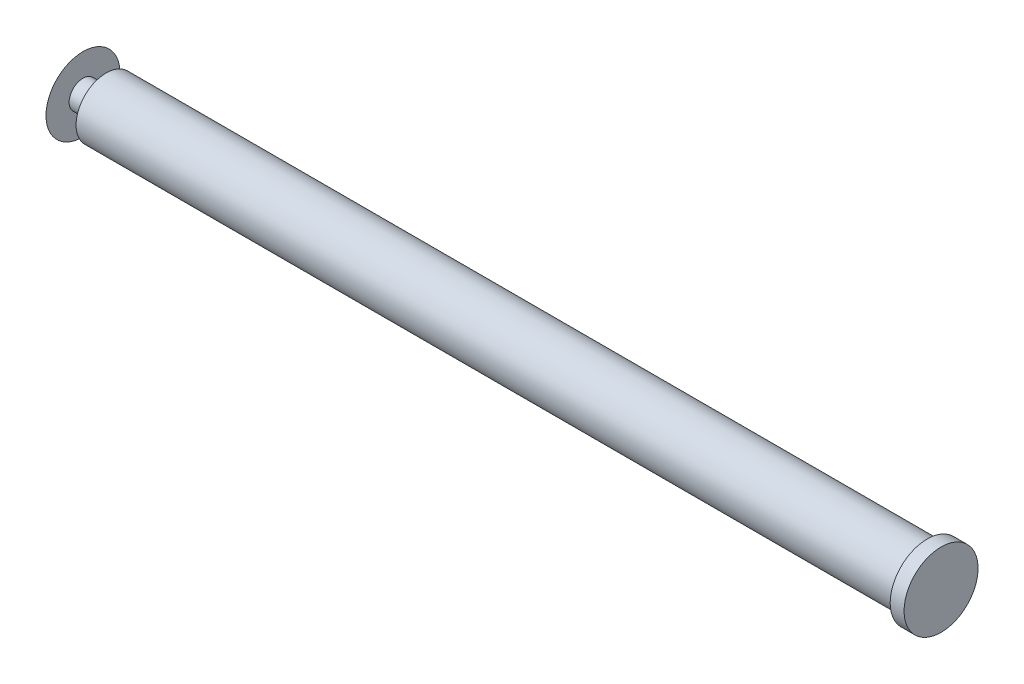
ISO-10303-21;
HEADER;
FILE_DESCRIPTION(('STEP AP214'),'2;1');
FILE_NAME('part.step','',(''),(''),'','','');
FILE_SCHEMA(('AUTOMOTIVE_DESIGN { 1 0 10303 214 1 1 1 1 }'));
ENDSEC;
DATA;
#1=APPLICATION_CONTEXT('core data for automotive mechanical design processes');
#2=APPLICATION_PROTOCOL_DEFINITION('international standard','automotive_design',2000,#1);
#3=PRODUCT_CONTEXT('',#1,'mechanical');
#4=PRODUCT('Part','Part','',(#3));
#5=PRODUCT_RELATED_PRODUCT_CATEGORY('part','',(#4));
#6=PRODUCT_DEFINITION_FORMATION('','',#4);
#7=PRODUCT_DEFINITION_CONTEXT('part definition',#1,'design');
#8=PRODUCT_DEFINITION('design','',#6,#7);
#9=PRODUCT_DEFINITION_SHAPE('','',#8);
#10=(LENGTH_UNIT() NAMED_UNIT(*) SI_UNIT(.MILLI.,.METRE.));
#11=(NAMED_UNIT(*) PLANE_ANGLE_UNIT() SI_UNIT($,.RADIAN.));
#12=(NAMED_UNIT(*) SI_UNIT($,.STERADIAN.) SOLID_ANGLE_UNIT());
#13=UNCERTAINTY_MEASURE_WITH_UNIT(LENGTH_MEASURE(1.E-05),#10,'distance_accuracy_value','');
#14=(GEOMETRIC_REPRESENTATION_CONTEXT(3) GLOBAL_UNCERTAINTY_ASSIGNED_CONTEXT((#13)) GLOBAL_UNIT_ASSIGNED_CONTEXT((#10,
#11,#12)) REPRESENTATION_CONTEXT('',''));
#15=CARTESIAN_POINT('',(0.,0.,0.));
#16=DIRECTION('',(0.,0.,1.));
#17=DIRECTION('',(1.,0.,0.));
#18=AXIS2_PLACEMENT_3D('',#15,#16,#17);
#19=CARTESIAN_POINT('',(319.63293238557,0.,0.));
#20=DIRECTION('',(-1.,0.,0.));
#21=DIRECTION('',(0.,0.,1.));
#22=AXIS2_PLACEMENT_3D('',#19,#20,#21);
#23=PLANE('',#22);
#24=CARTESIAN_POINT('',(319.63293238557,0.,0.));
#25=DIRECTION('',(-1.,0.,0.));
#26=DIRECTION('',(0.,0.,1.));
#27=AXIS2_PLACEMENT_3D('',#24,#25,#26);
#28=CIRCLE('',#27,16.);
#29=CARTESIAN_POINT('',(319.63293238557,0.,16.));
#30=VERTEX_POINT('',#29);
#31=EDGE_CURVE('E10',#30,#30,#28,.T.);
#32=ORIENTED_EDGE('',*,*,#31,.F.);
#33=EDGE_LOOP('',(#32));
#34=FACE_BOUND('',#33,.T.);
#35=ADVANCED_FACE('F33',(#34),#23,.F.);
#36=CARTESIAN_POINT('',(-129.81207353434,0.,0.));
#37=DIRECTION('',(-1.,0.,0.));
#38=DIRECTION('',(0.,0.,1.));
#39=AXIS2_PLACEMENT_3D('',#36,#37,#38);
#40=CYLINDRICAL_SURFACE('',#39,16.);
#41=CARTESIAN_POINT('',(313.63293238557,0.,0.));
#42=DIRECTION('',(-1.,0.,0.));
#43=DIRECTION('',(0.,0.,1.));
#44=AXIS2_PLACEMENT_3D('',#41,#42,#43);
#45=CIRCLE('',#44,16.);
#46=CARTESIAN_POINT('',(313.63293238557,0.,16.));
#47=VERTEX_POINT('',#46);
#48=EDGE_CURVE('E39',#47,#47,#45,.T.);
#49=ORIENTED_EDGE('',*,*,#48,.F.);
#50=EDGE_LOOP('',(#49));
#51=FACE_BOUND('',#50,.T.);
#52=ORIENTED_EDGE('',*,*,#31,.T.);
#53=EDGE_LOOP('',(#52));
#54=FACE_BOUND('',#53,.T.);
#55=ADVANCED_FACE('F90',(#51,#54),#40,.T.);
#56=CARTESIAN_POINT('',(313.63293238557,16.,0.));
#57=DIRECTION('',(1.,0.,0.));
#58=DIRECTION('',(0.,0.,-1.));
#59=AXIS2_PLACEMENT_3D('',#56,#57,#58);
#60=PLANE('',#59);
#61=CARTESIAN_POINT('',(313.63293238557,0.,0.));
#62=DIRECTION('',(-1.,0.,0.));
#63=DIRECTION('',(0.,0.,1.));
#64=AXIS2_PLACEMENT_3D('',#61,#62,#63);
#65=CIRCLE('',#64,13.);
#66=CARTESIAN_POINT('',(313.63293238557,0.,13.));
#67=VERTEX_POINT('',#66);
#68=EDGE_CURVE('E43',#67,#67,#65,.T.);
#69=ORIENTED_EDGE('',*,*,#68,.F.);
#70=EDGE_LOOP('',(#69));
#71=FACE_BOUND('',#70,.T.);
#72=ORIENTED_EDGE('',*,*,#48,.T.);
#73=EDGE_LOOP('',(#72));
#74=FACE_BOUND('',#73,.T.);
#75=ADVANCED_FACE('F85',(#71,#74),#60,.F.);
#76=CARTESIAN_POINT('',(-129.81207353434,0.,0.));
#77=DIRECTION('',(-1.,0.,0.));
#78=DIRECTION('',(0.,0.,1.));
#79=AXIS2_PLACEMENT_3D('',#76,#77,#78);
#80=CYLINDRICAL_SURFACE('',#79,13.);
#81=CARTESIAN_POINT('',(-41.3670676144297,0.,0.));
#82=DIRECTION('',(-1.,0.,0.));
#83=DIRECTION('',(0.,0.,1.));
#84=AXIS2_PLACEMENT_3D('',#81,#82,#83);
#85=CIRCLE('',#84,13.);
#86=CARTESIAN_POINT('',(-41.3670676144297,0.,13.));
#87=VERTEX_POINT('',#86);
#88=EDGE_CURVE('E47',#87,#87,#85,.T.);
#89=ORIENTED_EDGE('',*,*,#88,.F.);
#90=EDGE_LOOP('',(#89));
#91=FACE_BOUND('',#90,.T.);
#92=ORIENTED_EDGE('',*,*,#68,.T.);
#93=EDGE_LOOP('',(#92));
#94=FACE_BOUND('',#93,.T.);
#95=ADVANCED_FACE('F79',(#91,#94),#80,.T.);
#96=CARTESIAN_POINT('',(-41.3670676144297,13.,0.));
#97=DIRECTION('',(1.,0.,0.));
#98=DIRECTION('',(0.,0.,-1.));
#99=AXIS2_PLACEMENT_3D('',#96,#97,#98);
#100=PLANE('',#99);
#101=CARTESIAN_POINT('',(-41.3670676144297,0.,0.));
#102=DIRECTION('',(-1.,0.,0.));
#103=DIRECTION('',(0.,0.,1.));
#104=AXIS2_PLACEMENT_3D('',#101,#102,#103);
#105=CIRCLE('',#104,6.);
#106=CARTESIAN_POINT('',(-41.3670676144297,0.,6.));
#107=VERTEX_POINT('',#106);
#108=EDGE_CURVE('E52',#107,#107,#105,.T.);
#109=ORIENTED_EDGE('',*,*,#108,.F.);
#110=EDGE_LOOP('',(#109));
#111=FACE_BOUND('',#110,.T.);
#112=ORIENTED_EDGE('',*,*,#88,.T.);
#113=EDGE_LOOP('',(#112));
#114=FACE_BOUND('',#113,.T.);
#115=ADVANCED_FACE('F73',(#111,#114),#100,.F.);
#116=CARTESIAN_POINT('',(-129.81207353434,0.,0.));
#117=DIRECTION('',(-1.,0.,0.));
#118=DIRECTION('',(0.,0.,1.));
#119=AXIS2_PLACEMENT_3D('',#116,#117,#118);
#120=CYLINDRICAL_SURFACE('',#119,6.);
#121=CARTESIAN_POINT('',(-51.3670676144297,0.,0.));
#122=DIRECTION('',(-1.,0.,0.));
#123=DIRECTION('',(0.,0.,1.));
#124=AXIS2_PLACEMENT_3D('',#121,#122,#123);
#125=CIRCLE('',#124,6.);
#126=CARTESIAN_POINT('',(-51.3670676144297,0.,6.));
#127=VERTEX_POINT('',#126);
#128=EDGE_CURVE('E55',#127,#127,#125,.T.);
#129=ORIENTED_EDGE('',*,*,#128,.F.);
#130=EDGE_LOOP('',(#129));
#131=FACE_BOUND('',#130,.T.);
#132=ORIENTED_EDGE('',*,*,#108,.T.);
#133=EDGE_LOOP('',(#132));
#134=FACE_BOUND('',#133,.T.);
#135=ADVANCED_FACE('F67',(#131,#134),#120,.T.);
#136=CARTESIAN_POINT('',(-51.3670676144297,6.,0.));
#137=DIRECTION('',(-1.,0.,0.));
#138=DIRECTION('',(0.,0.,1.));
#139=AXIS2_PLACEMENT_3D('',#136,#137,#138);
#140=PLANE('',#139);
#141=CARTESIAN_POINT('',(-51.3670676144297,0.,0.));
#142=DIRECTION('',(-1.,0.,0.));
#143=DIRECTION('',(0.,0.,1.));
#144=AXIS2_PLACEMENT_3D('',#141,#142,#143);
#145=CIRCLE('',#144,16.);
#146=CARTESIAN_POINT('',(-51.3670676144297,0.,16.));
#147=VERTEX_POINT('',#146);
#148=EDGE_CURVE('E58',#147,#147,#145,.T.);
#149=ORIENTED_EDGE('',*,*,#148,.F.);
#150=EDGE_LOOP('',(#149));
#151=FACE_BOUND('',#150,.T.);
#152=ORIENTED_EDGE('',*,*,#128,.T.);
#153=EDGE_LOOP('',(#152));
#154=FACE_BOUND('',#153,.T.);
#155=ADVANCED_FACE('F64',(#151,#154),#140,.F.);
#156=CARTESIAN_POINT('',(-21.3670676144297,0.,0.));
#157=DIRECTION('',(-1.,0.,0.));
#158=DIRECTION('',(0.,1.,0.));
#159=AXIS2_PLACEMENT_3D('',#156,#157,#158);
#160=SPHERICAL_SURFACE('',#159,34.);
#161=ORIENTED_EDGE('',*,*,#148,.T.);
#162=EDGE_LOOP('',(#161));
#163=FACE_BOUND('',#162,.T.);
#164=ADVANCED_FACE('F62',(#163),#160,.T.);
#165=CLOSED_SHELL('',(#35,#55,#75,#95,#115,#135,#155,#164));
#166=MANIFOLD_SOLID_BREP('B2',#165);
#167=ADVANCED_BREP_SHAPE_REPRESENTATION('',(#18,#166),#14);
#168=SHAPE_DEFINITION_REPRESENTATION(#9,#167);
ENDSEC;
END-ISO-10303-21;
